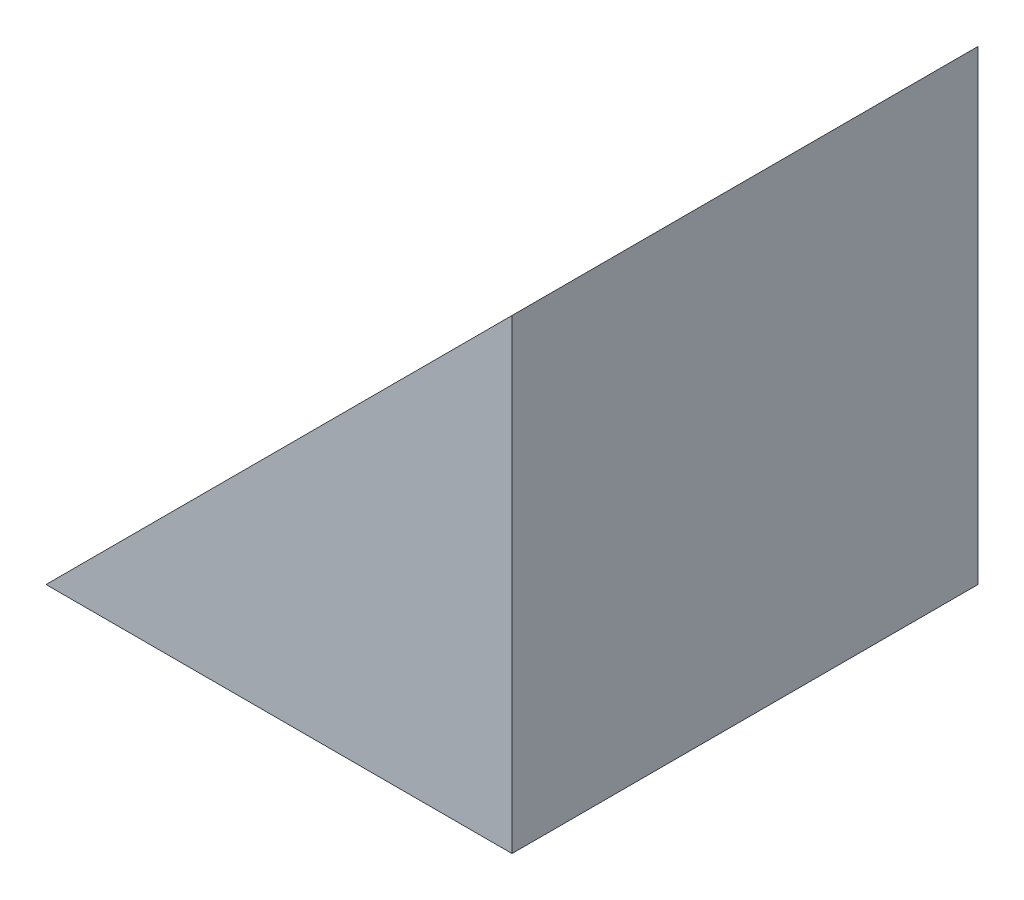
ISO-10303-21;
HEADER;
FILE_DESCRIPTION(('STEP AP214'),'2;1');
FILE_NAME('part.step','',(''),(''),'','','');
FILE_SCHEMA(('AUTOMOTIVE_DESIGN { 1 0 10303 214 1 1 1 1 }'));
ENDSEC;
DATA;
#1=APPLICATION_CONTEXT('core data for automotive mechanical design processes');
#2=APPLICATION_PROTOCOL_DEFINITION('international standard','automotive_design',2000,#1);
#3=PRODUCT_CONTEXT('',#1,'mechanical');
#4=PRODUCT('Part','Part','',(#3));
#5=PRODUCT_RELATED_PRODUCT_CATEGORY('part','',(#4));
#6=PRODUCT_DEFINITION_FORMATION('','',#4);
#7=PRODUCT_DEFINITION_CONTEXT('part definition',#1,'design');
#8=PRODUCT_DEFINITION('design','',#6,#7);
#9=PRODUCT_DEFINITION_SHAPE('','',#8);
#10=(LENGTH_UNIT() NAMED_UNIT(*) SI_UNIT(.MILLI.,.METRE.));
#11=(NAMED_UNIT(*) PLANE_ANGLE_UNIT() SI_UNIT($,.RADIAN.));
#12=(NAMED_UNIT(*) SI_UNIT($,.STERADIAN.) SOLID_ANGLE_UNIT());
#13=UNCERTAINTY_MEASURE_WITH_UNIT(LENGTH_MEASURE(1.E-05),#10,'distance_accuracy_value','');
#14=(GEOMETRIC_REPRESENTATION_CONTEXT(3) GLOBAL_UNCERTAINTY_ASSIGNED_CONTEXT((#13)) GLOBAL_UNIT_ASSIGNED_CONTEXT((#10,
#11,#12)) REPRESENTATION_CONTEXT('',''));
#15=CARTESIAN_POINT('',(0.,0.,0.));
#16=DIRECTION('',(0.,0.,1.));
#17=DIRECTION('',(1.,0.,0.));
#18=AXIS2_PLACEMENT_3D('',#15,#16,#17);
#19=CARTESIAN_POINT('',(34.9428127421811,26.5558140480612,10.));
#20=DIRECTION('',(0.,1.,0.));
#21=DIRECTION('',(0.,0.,1.));
#22=AXIS2_PLACEMENT_3D('',#19,#20,#21);
#23=PLANE('',#22);
#24=DIRECTION('',(1.,0.,0.));
#25=VECTOR('',#24,1.);
#26=CARTESIAN_POINT('',(34.9428127421811,26.5558140480612,0.));
#27=LINE('',#26,#25);
#28=CARTESIAN_POINT('',(24.9428127421811,26.5558140480612,0.));
#29=VERTEX_POINT('',#28);
#30=CARTESIAN_POINT('',(34.9428127421811,26.5558140480612,0.));
#31=VERTEX_POINT('',#30);
#32=EDGE_CURVE('E82',#29,#31,#27,.T.);
#33=ORIENTED_EDGE('',*,*,#32,.T.);
#34=DIRECTION('',(0.,0.,-1.));
#35=VECTOR('',#34,1.);
#36=CARTESIAN_POINT('',(34.9428127421811,26.5558140480612,10.));
#37=LINE('',#36,#35);
#38=CARTESIAN_POINT('',(34.9428127421811,26.5558140480612,10.));
#39=VERTEX_POINT('',#38);
#40=EDGE_CURVE('E11',#39,#31,#37,.T.);
#41=ORIENTED_EDGE('',*,*,#40,.F.);
#42=DIRECTION('',(1.,0.,0.));
#43=VECTOR('',#42,1.);
#44=CARTESIAN_POINT('',(34.9428127421811,26.5558140480612,10.));
#45=LINE('',#44,#43);
#46=CARTESIAN_POINT('',(24.9428127421811,26.5558140480612,10.));
#47=VERTEX_POINT('',#46);
#48=EDGE_CURVE('E75',#47,#39,#45,.T.);
#49=ORIENTED_EDGE('',*,*,#48,.F.);
#50=DIRECTION('',(0.,0.,-1.));
#51=VECTOR('',#50,1.);
#52=CARTESIAN_POINT('',(24.9428127421811,26.5558140480612,10.));
#53=LINE('',#52,#51);
#54=EDGE_CURVE('E83',#47,#29,#53,.T.);
#55=ORIENTED_EDGE('',*,*,#54,.T.);
#56=EDGE_LOOP('',(#33,#41,#49,#55));
#57=FACE_BOUND('',#56,.T.);
#58=ADVANCED_FACE('F35',(#57),#23,.F.);
#59=CARTESIAN_POINT('',(34.9428127421811,26.5558140480612,10.));
#60=DIRECTION('',(-1.,0.,0.));
#61=DIRECTION('',(0.,0.,1.));
#62=AXIS2_PLACEMENT_3D('',#59,#60,#61);
#63=PLANE('',#62);
#64=DIRECTION('',(0.,1.,0.));
#65=VECTOR('',#64,1.);
#66=CARTESIAN_POINT('',(34.9428127421811,26.5558140480612,0.));
#67=LINE('',#66,#65);
#68=CARTESIAN_POINT('',(34.9428127421811,36.5558140480612,0.));
#69=VERTEX_POINT('',#68);
#70=EDGE_CURVE('E63',#31,#69,#67,.T.);
#71=ORIENTED_EDGE('',*,*,#70,.T.);
#72=DIRECTION('',(0.,0.,-1.));
#73=VECTOR('',#72,1.);
#74=CARTESIAN_POINT('',(34.9428127421811,36.5558140480612,10.));
#75=LINE('',#74,#73);
#76=CARTESIAN_POINT('',(34.9428127421811,36.5558140480612,10.));
#77=VERTEX_POINT('',#76);
#78=EDGE_CURVE('E43',#77,#69,#75,.T.);
#79=ORIENTED_EDGE('',*,*,#78,.F.);
#80=DIRECTION('',(0.,1.,0.));
#81=VECTOR('',#80,1.);
#82=CARTESIAN_POINT('',(34.9428127421811,26.5558140480612,10.));
#83=LINE('',#82,#81);
#84=EDGE_CURVE('E71',#39,#77,#83,.T.);
#85=ORIENTED_EDGE('',*,*,#84,.F.);
#86=ORIENTED_EDGE('',*,*,#40,.T.);
#87=EDGE_LOOP('',(#71,#79,#85,#86));
#88=FACE_BOUND('',#87,.T.);
#89=ADVANCED_FACE('F72',(#88),#63,.F.);
#90=CARTESIAN_POINT('',(24.9428127421811,26.5558140480612,10.));
#91=DIRECTION('',(0.707106781186548,-0.707106781186548,0.));
#92=DIRECTION('',(0.707106781186548,0.707106781186548,0.));
#93=AXIS2_PLACEMENT_3D('',#90,#91,#92);
#94=PLANE('',#93);
#95=DIRECTION('',(-0.707106781186548,-0.707106781186548,0.));
#96=VECTOR('',#95,1.);
#97=CARTESIAN_POINT('',(24.9428127421811,26.5558140480612,0.));
#98=LINE('',#97,#96);
#99=EDGE_CURVE('E68',#69,#29,#98,.T.);
#100=ORIENTED_EDGE('',*,*,#99,.T.);
#101=ORIENTED_EDGE('',*,*,#54,.F.);
#102=DIRECTION('',(-0.707106781186548,-0.707106781186548,0.));
#103=VECTOR('',#102,1.);
#104=CARTESIAN_POINT('',(24.9428127421811,26.5558140480612,10.));
#105=LINE('',#104,#103);
#106=EDGE_CURVE('E51',#77,#47,#105,.T.);
#107=ORIENTED_EDGE('',*,*,#106,.F.);
#108=ORIENTED_EDGE('',*,*,#78,.T.);
#109=EDGE_LOOP('',(#100,#101,#107,#108));
#110=FACE_BOUND('',#109,.T.);
#111=ADVANCED_FACE('F90',(#110),#94,.F.);
#112=CARTESIAN_POINT('',(0.,0.,10.));
#113=DIRECTION('',(0.,0.,-1.));
#114=DIRECTION('',(-1.,0.,0.));
#115=AXIS2_PLACEMENT_3D('',#112,#113,#114);
#116=PLANE('',#115);
#117=ORIENTED_EDGE('',*,*,#48,.T.);
#118=ORIENTED_EDGE('',*,*,#84,.T.);
#119=ORIENTED_EDGE('',*,*,#106,.T.);
#120=EDGE_LOOP('',(#117,#118,#119));
#121=FACE_BOUND('',#120,.T.);
#122=ADVANCED_FACE('F78',(#121),#116,.F.);
#123=CARTESIAN_POINT('',(0.,0.,0.));
#124=DIRECTION('',(0.,0.,-1.));
#125=DIRECTION('',(-1.,0.,0.));
#126=AXIS2_PLACEMENT_3D('',#123,#124,#125);
#127=PLANE('',#126);
#128=ORIENTED_EDGE('',*,*,#32,.F.);
#129=ORIENTED_EDGE('',*,*,#99,.F.);
#130=ORIENTED_EDGE('',*,*,#70,.F.);
#131=EDGE_LOOP('',(#128,#129,#130));
#132=FACE_BOUND('',#131,.T.);
#133=ADVANCED_FACE('F91',(#132),#127,.T.);
#134=CLOSED_SHELL('',(#58,#89,#111,#122,#133));
#135=MANIFOLD_SOLID_BREP('B2',#134);
#136=ADVANCED_BREP_SHAPE_REPRESENTATION('',(#18,#135),#14);
#137=SHAPE_DEFINITION_REPRESENTATION(#9,#136);
ENDSEC;
END-ISO-10303-21;
